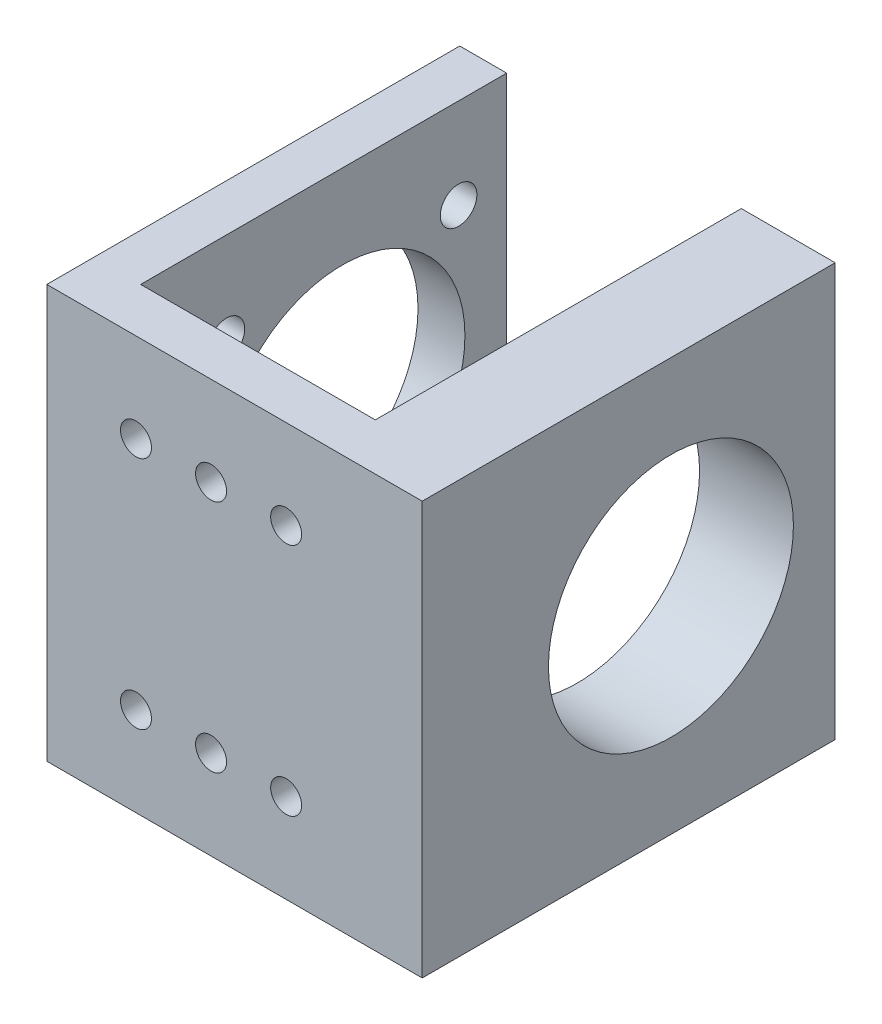
ISO-10303-21;
HEADER;
FILE_DESCRIPTION(('STEP AP214'),'2;1');
FILE_NAME('part.step','',(''),(''),'','','');
FILE_SCHEMA(('AUTOMOTIVE_DESIGN { 1 0 10303 214 1 1 1 1 }'));
ENDSEC;
DATA;
#1=APPLICATION_CONTEXT('core data for automotive mechanical design processes');
#2=APPLICATION_PROTOCOL_DEFINITION('international standard','automotive_design',2000,#1);
#3=PRODUCT_CONTEXT('',#1,'mechanical');
#4=PRODUCT('Part','Part','',(#3));
#5=PRODUCT_RELATED_PRODUCT_CATEGORY('part','',(#4));
#6=PRODUCT_DEFINITION_FORMATION('','',#4);
#7=PRODUCT_DEFINITION_CONTEXT('part definition',#1,'design');
#8=PRODUCT_DEFINITION('design','',#6,#7);
#9=PRODUCT_DEFINITION_SHAPE('','',#8);
#10=(LENGTH_UNIT() NAMED_UNIT(*) SI_UNIT(.MILLI.,.METRE.));
#11=(NAMED_UNIT(*) PLANE_ANGLE_UNIT() SI_UNIT($,.RADIAN.));
#12=(NAMED_UNIT(*) SI_UNIT($,.STERADIAN.) SOLID_ANGLE_UNIT());
#13=UNCERTAINTY_MEASURE_WITH_UNIT(LENGTH_MEASURE(1.E-05),#10,'distance_accuracy_value','');
#14=(GEOMETRIC_REPRESENTATION_CONTEXT(3) GLOBAL_UNCERTAINTY_ASSIGNED_CONTEXT((#13)) GLOBAL_UNIT_ASSIGNED_CONTEXT((#10,
#11,#12)) REPRESENTATION_CONTEXT('',''));
#15=CARTESIAN_POINT('',(0.,0.,0.));
#16=DIRECTION('',(0.,0.,1.));
#17=DIRECTION('',(1.,0.,0.));
#18=AXIS2_PLACEMENT_3D('',#15,#16,#17);
#19=CARTESIAN_POINT('',(-42.2330948121646,44.,18.4776386404293));
#20=DIRECTION('',(0.,0.,1.));
#21=DIRECTION('',(1.,0.,0.));
#22=AXIS2_PLACEMENT_3D('',#19,#20,#21);
#23=PLANE('',#22);
#24=DIRECTION('',(-1.,0.,0.));
#25=VECTOR('',#24,1.);
#26=CARTESIAN_POINT('',(-42.2330948121646,0.,18.4776386404293));
#27=LINE('',#26,#25);
#28=CARTESIAN_POINT('',(-42.2330948121646,0.,18.4776386404293));
#29=VERTEX_POINT('',#28);
#30=CARTESIAN_POINT('',(-47.2330948121646,0.,18.4776386404293));
#31=VERTEX_POINT('',#30);
#32=EDGE_CURVE('E131',#29,#31,#27,.T.);
#33=ORIENTED_EDGE('',*,*,#32,.T.);
#34=DIRECTION('',(0.,-1.,0.));
#35=VECTOR('',#34,1.);
#36=CARTESIAN_POINT('',(-47.2330948121646,44.,18.4776386404293));
#37=LINE('',#36,#35);
#38=CARTESIAN_POINT('',(-47.2330948121646,44.,18.4776386404293));
#39=VERTEX_POINT('',#38);
#40=EDGE_CURVE('E11',#39,#31,#37,.T.);
#41=ORIENTED_EDGE('',*,*,#40,.F.);
#42=DIRECTION('',(-1.,0.,0.));
#43=VECTOR('',#42,1.);
#44=CARTESIAN_POINT('',(-42.2330948121646,44.,18.4776386404293));
#45=LINE('',#44,#43);
#46=CARTESIAN_POINT('',(-42.2330948121646,44.,18.4776386404293));
#47=VERTEX_POINT('',#46);
#48=EDGE_CURVE('E146',#47,#39,#45,.T.);
#49=ORIENTED_EDGE('',*,*,#48,.F.);
#50=DIRECTION('',(0.,-1.,0.));
#51=VECTOR('',#50,1.);
#52=CARTESIAN_POINT('',(-42.2330948121646,44.,18.4776386404293));
#53=LINE('',#52,#51);
#54=EDGE_CURVE('E127',#47,#29,#53,.T.);
#55=ORIENTED_EDGE('',*,*,#54,.T.);
#56=EDGE_LOOP('',(#33,#41,#49,#55));
#57=FACE_BOUND('',#56,.T.);
#58=ADVANCED_FACE('F34',(#57),#23,.F.);
#59=CARTESIAN_POINT('',(-47.2330948121646,44.,18.4776386404293));
#60=DIRECTION('',(1.,0.,0.));
#61=DIRECTION('',(0.,0.,-1.));
#62=AXIS2_PLACEMENT_3D('',#59,#60,#61);
#63=PLANE('',#62);
#64=CARTESIAN_POINT('',(-47.2330948121646,22.,35.9776386404293));
#65=DIRECTION('',(1.,0.,0.));
#66=DIRECTION('',(0.,0.,-1.));
#67=AXIS2_PLACEMENT_3D('',#64,#65,#66);
#68=CIRCLE('',#67,13.05);
#69=CARTESIAN_POINT('',(-47.2330948121646,22.,22.9276386404293));
#70=VERTEX_POINT('',#69);
#71=EDGE_CURVE('E229',#70,#70,#68,.T.);
#72=ORIENTED_EDGE('',*,*,#71,.T.);
#73=EDGE_LOOP('',(#72));
#74=FACE_BOUND('',#73,.T.);
#75=CARTESIAN_POINT('',(-47.2330948121646,34.375,23.6032386404294));
#76=DIRECTION('',(-1.,0.,0.));
#77=DIRECTION('',(0.,0.,1.));
#78=AXIS2_PLACEMENT_3D('',#75,#76,#77);
#79=CIRCLE('',#78,1.95);
#80=CARTESIAN_POINT('',(-47.2330948121646,34.375,25.5532386404294));
#81=VERTEX_POINT('',#80);
#82=EDGE_CURVE('E233',#81,#81,#79,.T.);
#83=ORIENTED_EDGE('',*,*,#82,.F.);
#84=EDGE_LOOP('',(#83));
#85=FACE_BOUND('',#84,.T.);
#86=CARTESIAN_POINT('',(-47.2330948121646,9.62499999999983,48.3432386404293));
#87=DIRECTION('',(-1.,0.,0.));
#88=DIRECTION('',(0.,0.,1.));
#89=AXIS2_PLACEMENT_3D('',#86,#87,#88);
#90=CIRCLE('',#89,1.95);
#91=CARTESIAN_POINT('',(-47.2330948121646,9.62499999999983,50.2932386404293));
#92=VERTEX_POINT('',#91);
#93=EDGE_CURVE('E225',#92,#92,#90,.T.);
#94=ORIENTED_EDGE('',*,*,#93,.F.);
#95=EDGE_LOOP('',(#94));
#96=FACE_BOUND('',#95,.T.);
#97=CARTESIAN_POINT('',(-47.2330948121646,9.625,23.6032386404293));
#98=DIRECTION('',(-1.,0.,0.));
#99=DIRECTION('',(0.,0.,1.));
#100=AXIS2_PLACEMENT_3D('',#97,#98,#99);
#101=CIRCLE('',#100,1.95);
#102=CARTESIAN_POINT('',(-47.2330948121646,9.625,25.5532386404293));
#103=VERTEX_POINT('',#102);
#104=EDGE_CURVE('E226',#103,#103,#101,.T.);
#105=ORIENTED_EDGE('',*,*,#104,.F.);
#106=EDGE_LOOP('',(#105));
#107=FACE_BOUND('',#106,.T.);
#108=CARTESIAN_POINT('',(-47.2330948121646,34.3749999999998,48.3432386404294));
#109=DIRECTION('',(-1.,0.,0.));
#110=DIRECTION('',(0.,0.,1.));
#111=AXIS2_PLACEMENT_3D('',#108,#109,#110);
#112=CIRCLE('',#111,1.95);
#113=CARTESIAN_POINT('',(-47.2330948121646,34.3749999999998,50.2932386404294));
#114=VERTEX_POINT('',#113);
#115=EDGE_CURVE('E218',#114,#114,#112,.T.);
#116=ORIENTED_EDGE('',*,*,#115,.F.);
#117=EDGE_LOOP('',(#116));
#118=FACE_BOUND('',#117,.T.);
#119=DIRECTION('',(0.,0.,1.));
#120=VECTOR('',#119,1.);
#121=CARTESIAN_POINT('',(-47.2330948121646,0.,18.4776386404293));
#122=LINE('',#121,#120);
#123=CARTESIAN_POINT('',(-47.2330948121646,0.,62.4776386404293));
#124=VERTEX_POINT('',#123);
#125=EDGE_CURVE('E134',#31,#124,#122,.T.);
#126=ORIENTED_EDGE('',*,*,#125,.T.);
#127=DIRECTION('',(0.,-1.,0.));
#128=VECTOR('',#127,1.);
#129=CARTESIAN_POINT('',(-47.2330948121646,44.,62.4776386404293));
#130=LINE('',#129,#128);
#131=CARTESIAN_POINT('',(-47.2330948121646,44.,62.4776386404293));
#132=VERTEX_POINT('',#131);
#133=EDGE_CURVE('E43',#132,#124,#130,.T.);
#134=ORIENTED_EDGE('',*,*,#133,.F.);
#135=DIRECTION('',(0.,0.,1.));
#136=VECTOR('',#135,1.);
#137=CARTESIAN_POINT('',(-47.2330948121646,44.,18.4776386404293));
#138=LINE('',#137,#136);
#139=EDGE_CURVE('E94',#39,#132,#138,.T.);
#140=ORIENTED_EDGE('',*,*,#139,.F.);
#141=ORIENTED_EDGE('',*,*,#40,.T.);
#142=EDGE_LOOP('',(#126,#134,#140,#141));
#143=FACE_BOUND('',#142,.T.);
#144=ADVANCED_FACE('F263',(#74,#85,#96,#107,#118,#143),#63,.F.);
#145=CARTESIAN_POINT('',(-47.2330948121646,44.,62.4776386404293));
#146=DIRECTION('',(0.,0.,-1.));
#147=DIRECTION('',(-1.,0.,0.));
#148=AXIS2_PLACEMENT_3D('',#145,#146,#147);
#149=PLANE('',#148);
#150=CARTESIAN_POINT('',(-21.7330948121648,9.49999999999988,62.4776386404293));
#151=DIRECTION('',(0.,0.,-1.));
#152=DIRECTION('',(-1.,0.,0.));
#153=AXIS2_PLACEMENT_3D('',#150,#151,#152);
#154=CIRCLE('',#153,1.65);
#155=CARTESIAN_POINT('',(-23.3830948121648,9.49999999999988,62.4776386404293));
#156=VERTEX_POINT('',#155);
#157=EDGE_CURVE('E185',#156,#156,#154,.T.);
#158=ORIENTED_EDGE('',*,*,#157,.T.);
#159=EDGE_LOOP('',(#158));
#160=FACE_BOUND('',#159,.T.);
#161=CARTESIAN_POINT('',(-21.7330948121645,34.4999999999999,62.4776386404293));
#162=DIRECTION('',(0.,0.,-1.));
#163=DIRECTION('',(-1.,0.,0.));
#164=AXIS2_PLACEMENT_3D('',#161,#162,#163);
#165=CIRCLE('',#164,1.65);
#166=CARTESIAN_POINT('',(-23.3830948121645,34.4999999999999,62.4776386404293));
#167=VERTEX_POINT('',#166);
#168=EDGE_CURVE('E188',#167,#167,#165,.T.);
#169=ORIENTED_EDGE('',*,*,#168,.T.);
#170=EDGE_LOOP('',(#169));
#171=FACE_BOUND('',#170,.T.);
#172=CARTESIAN_POINT('',(-37.7330948121648,9.49999999999999,62.4776386404293));
#173=DIRECTION('',(0.,0.,-1.));
#174=DIRECTION('',(-1.,0.,0.));
#175=AXIS2_PLACEMENT_3D('',#172,#173,#174);
#176=CIRCLE('',#175,1.65);
#177=CARTESIAN_POINT('',(-39.3830948121648,9.49999999999999,62.4776386404293));
#178=VERTEX_POINT('',#177);
#179=EDGE_CURVE('E191',#178,#178,#176,.T.);
#180=ORIENTED_EDGE('',*,*,#179,.T.);
#181=EDGE_LOOP('',(#180));
#182=FACE_BOUND('',#181,.T.);
#183=CARTESIAN_POINT('',(-37.7330948121646,34.5,62.4776386404293));
#184=DIRECTION('',(0.,0.,-1.));
#185=DIRECTION('',(-1.,0.,0.));
#186=AXIS2_PLACEMENT_3D('',#183,#184,#185);
#187=CIRCLE('',#186,1.65);
#188=CARTESIAN_POINT('',(-39.3830948121646,34.5,62.4776386404293));
#189=VERTEX_POINT('',#188);
#190=EDGE_CURVE('E194',#189,#189,#187,.T.);
#191=ORIENTED_EDGE('',*,*,#190,.T.);
#192=EDGE_LOOP('',(#191));
#193=FACE_BOUND('',#192,.T.);
#194=CARTESIAN_POINT('',(-29.7330948121648,9.49999999999994,62.4776386404293));
#195=DIRECTION('',(0.,0.,-1.));
#196=DIRECTION('',(-1.,0.,0.));
#197=AXIS2_PLACEMENT_3D('',#194,#195,#196);
#198=CIRCLE('',#197,1.65000000000001);
#199=CARTESIAN_POINT('',(-31.3830948121648,9.49999999999994,62.4776386404293));
#200=VERTEX_POINT('',#199);
#201=EDGE_CURVE('E197',#200,#200,#198,.T.);
#202=ORIENTED_EDGE('',*,*,#201,.T.);
#203=EDGE_LOOP('',(#202));
#204=FACE_BOUND('',#203,.T.);
#205=CARTESIAN_POINT('',(-29.7330948121645,34.4999999999999,62.4776386404293));
#206=DIRECTION('',(0.,0.,-1.));
#207=DIRECTION('',(-1.,0.,0.));
#208=AXIS2_PLACEMENT_3D('',#205,#206,#207);
#209=CIRCLE('',#208,1.65000000000001);
#210=CARTESIAN_POINT('',(-31.3830948121646,34.4999999999999,62.4776386404293));
#211=VERTEX_POINT('',#210);
#212=EDGE_CURVE('E135',#211,#211,#209,.T.);
#213=ORIENTED_EDGE('',*,*,#212,.T.);
#214=EDGE_LOOP('',(#213));
#215=FACE_BOUND('',#214,.T.);
#216=DIRECTION('',(1.,0.,0.));
#217=VECTOR('',#216,1.);
#218=CARTESIAN_POINT('',(-47.2330948121646,0.,62.4776386404293));
#219=LINE('',#218,#217);
#220=CARTESIAN_POINT('',(-7.23309481216456,0.,62.4776386404293));
#221=VERTEX_POINT('',#220);
#222=EDGE_CURVE('E137',#124,#221,#219,.T.);
#223=ORIENTED_EDGE('',*,*,#222,.T.);
#224=DIRECTION('',(0.,-1.,0.));
#225=VECTOR('',#224,1.);
#226=CARTESIAN_POINT('',(-7.23309481216456,44.,62.4776386404293));
#227=LINE('',#226,#225);
#228=CARTESIAN_POINT('',(-7.23309481216456,44.,62.4776386404293));
#229=VERTEX_POINT('',#228);
#230=EDGE_CURVE('E153',#229,#221,#227,.T.);
#231=ORIENTED_EDGE('',*,*,#230,.F.);
#232=DIRECTION('',(1.,0.,0.));
#233=VECTOR('',#232,1.);
#234=CARTESIAN_POINT('',(-47.2330948121646,44.,62.4776386404293));
#235=LINE('',#234,#233);
#236=EDGE_CURVE('E162',#132,#229,#235,.T.);
#237=ORIENTED_EDGE('',*,*,#236,.F.);
#238=ORIENTED_EDGE('',*,*,#133,.T.);
#239=EDGE_LOOP('',(#223,#231,#237,#238));
#240=FACE_BOUND('',#239,.T.);
#241=ADVANCED_FACE('F160',(#160,#171,#182,#193,#204,#215,#240),#149,.F.);
#242=CARTESIAN_POINT('',(-7.23309481216456,44.,62.4776386404293));
#243=DIRECTION('',(-1.,0.,0.));
#244=DIRECTION('',(0.,0.,1.));
#245=AXIS2_PLACEMENT_3D('',#242,#243,#244);
#246=PLANE('',#245);
#247=CARTESIAN_POINT('',(-7.23309481216456,22.,35.9776386404293));
#248=DIRECTION('',(1.,0.,0.));
#249=DIRECTION('',(0.,0.,-1.));
#250=AXIS2_PLACEMENT_3D('',#247,#248,#249);
#251=CIRCLE('',#250,13.05);
#252=CARTESIAN_POINT('',(-7.23309481216456,22.,22.9276386404293));
#253=VERTEX_POINT('',#252);
#254=EDGE_CURVE('E245',#253,#253,#251,.T.);
#255=ORIENTED_EDGE('',*,*,#254,.F.);
#256=EDGE_LOOP('',(#255));
#257=FACE_BOUND('',#256,.T.);
#258=DIRECTION('',(0.,0.,-1.));
#259=VECTOR('',#258,1.);
#260=CARTESIAN_POINT('',(-7.23309481216456,0.,62.4776386404293));
#261=LINE('',#260,#259);
#262=CARTESIAN_POINT('',(-7.23309481216456,0.,18.4776386404293));
#263=VERTEX_POINT('',#262);
#264=EDGE_CURVE('E139',#221,#263,#261,.T.);
#265=ORIENTED_EDGE('',*,*,#264,.T.);
#266=DIRECTION('',(0.,-1.,0.));
#267=VECTOR('',#266,1.);
#268=CARTESIAN_POINT('',(-7.23309481216456,44.,18.4776386404293));
#269=LINE('',#268,#267);
#270=CARTESIAN_POINT('',(-7.23309481216456,44.,18.4776386404293));
#271=VERTEX_POINT('',#270);
#272=EDGE_CURVE('E150',#271,#263,#269,.T.);
#273=ORIENTED_EDGE('',*,*,#272,.F.);
#274=DIRECTION('',(0.,0.,-1.));
#275=VECTOR('',#274,1.);
#276=CARTESIAN_POINT('',(-7.23309481216456,44.,62.4776386404293));
#277=LINE('',#276,#275);
#278=EDGE_CURVE('E174',#229,#271,#277,.T.);
#279=ORIENTED_EDGE('',*,*,#278,.F.);
#280=ORIENTED_EDGE('',*,*,#230,.T.);
#281=EDGE_LOOP('',(#265,#273,#279,#280));
#282=FACE_BOUND('',#281,.T.);
#283=ADVANCED_FACE('F170',(#257,#282),#246,.F.);
#284=CARTESIAN_POINT('',(-7.23309481216456,44.,18.4776386404293));
#285=DIRECTION('',(0.,0.,1.));
#286=DIRECTION('',(1.,0.,0.));
#287=AXIS2_PLACEMENT_3D('',#284,#285,#286);
#288=PLANE('',#287);
#289=DIRECTION('',(-1.,0.,0.));
#290=VECTOR('',#289,1.);
#291=CARTESIAN_POINT('',(-7.23309481216456,0.,18.4776386404293));
#292=LINE('',#291,#290);
#293=CARTESIAN_POINT('',(-17.2330948121646,0.,18.4776386404293));
#294=VERTEX_POINT('',#293);
#295=EDGE_CURVE('E141',#263,#294,#292,.T.);
#296=ORIENTED_EDGE('',*,*,#295,.T.);
#297=DIRECTION('',(0.,-1.,0.));
#298=VECTOR('',#297,1.);
#299=CARTESIAN_POINT('',(-17.2330948121646,44.,18.4776386404293));
#300=LINE('',#299,#298);
#301=CARTESIAN_POINT('',(-17.2330948121646,44.,18.4776386404293));
#302=VERTEX_POINT('',#301);
#303=EDGE_CURVE('E122',#302,#294,#300,.T.);
#304=ORIENTED_EDGE('',*,*,#303,.F.);
#305=DIRECTION('',(-1.,0.,0.));
#306=VECTOR('',#305,1.);
#307=CARTESIAN_POINT('',(-7.23309481216456,44.,18.4776386404293));
#308=LINE('',#307,#306);
#309=EDGE_CURVE('E113',#271,#302,#308,.T.);
#310=ORIENTED_EDGE('',*,*,#309,.F.);
#311=ORIENTED_EDGE('',*,*,#272,.T.);
#312=EDGE_LOOP('',(#296,#304,#310,#311));
#313=FACE_BOUND('',#312,.T.);
#314=ADVANCED_FACE('F173',(#313),#288,.F.);
#315=CARTESIAN_POINT('',(-17.2330948121646,44.,18.4776386404293));
#316=DIRECTION('',(1.,0.,0.));
#317=DIRECTION('',(0.,0.,-1.));
#318=AXIS2_PLACEMENT_3D('',#315,#316,#317);
#319=PLANE('',#318);
#320=CARTESIAN_POINT('',(-17.2330948121646,22.,35.9776386404293));
#321=DIRECTION('',(1.,0.,0.));
#322=DIRECTION('',(0.,0.,-1.));
#323=AXIS2_PLACEMENT_3D('',#320,#321,#322);
#324=CIRCLE('',#323,13.05);
#325=CARTESIAN_POINT('',(-17.2330948121646,22.,22.9276386404293));
#326=VERTEX_POINT('',#325);
#327=EDGE_CURVE('E242',#326,#326,#324,.T.);
#328=ORIENTED_EDGE('',*,*,#327,.T.);
#329=EDGE_LOOP('',(#328));
#330=FACE_BOUND('',#329,.T.);
#331=DIRECTION('',(0.,0.,1.));
#332=VECTOR('',#331,1.);
#333=CARTESIAN_POINT('',(-17.2330948121646,0.,18.4776386404293));
#334=LINE('',#333,#332);
#335=CARTESIAN_POINT('',(-17.2330948121646,0.,57.4776386404293));
#336=VERTEX_POINT('',#335);
#337=EDGE_CURVE('E121',#294,#336,#334,.T.);
#338=ORIENTED_EDGE('',*,*,#337,.T.);
#339=DIRECTION('',(0.,-1.,0.));
#340=VECTOR('',#339,1.);
#341=CARTESIAN_POINT('',(-17.2330948121646,44.,57.4776386404293));
#342=LINE('',#341,#340);
#343=CARTESIAN_POINT('',(-17.2330948121646,44.,57.4776386404293));
#344=VERTEX_POINT('',#343);
#345=EDGE_CURVE('E118',#344,#336,#342,.T.);
#346=ORIENTED_EDGE('',*,*,#345,.F.);
#347=DIRECTION('',(0.,0.,1.));
#348=VECTOR('',#347,1.);
#349=CARTESIAN_POINT('',(-17.2330948121646,44.,18.4776386404293));
#350=LINE('',#349,#348);
#351=EDGE_CURVE('E107',#302,#344,#350,.T.);
#352=ORIENTED_EDGE('',*,*,#351,.F.);
#353=ORIENTED_EDGE('',*,*,#303,.T.);
#354=EDGE_LOOP('',(#338,#346,#352,#353));
#355=FACE_BOUND('',#354,.T.);
#356=ADVANCED_FACE('F119',(#330,#355),#319,.F.);
#357=CARTESIAN_POINT('',(-17.2330948121646,44.,57.4776386404293));
#358=DIRECTION('',(0.,0.,1.));
#359=DIRECTION('',(1.,0.,0.));
#360=AXIS2_PLACEMENT_3D('',#357,#358,#359);
#361=PLANE('',#360);
#362=CARTESIAN_POINT('',(-21.7330948121648,9.49999999999988,57.4776386404293));
#363=DIRECTION('',(0.,0.,-1.));
#364=DIRECTION('',(-1.,0.,0.));
#365=AXIS2_PLACEMENT_3D('',#362,#363,#364);
#366=CIRCLE('',#365,1.65);
#367=CARTESIAN_POINT('',(-23.3830948121648,9.49999999999988,57.4776386404293));
#368=VERTEX_POINT('',#367);
#369=EDGE_CURVE('E207',#368,#368,#366,.T.);
#370=ORIENTED_EDGE('',*,*,#369,.F.);
#371=EDGE_LOOP('',(#370));
#372=FACE_BOUND('',#371,.T.);
#373=CARTESIAN_POINT('',(-21.7330948121645,34.4999999999999,57.4776386404293));
#374=DIRECTION('',(0.,0.,-1.));
#375=DIRECTION('',(-1.,0.,0.));
#376=AXIS2_PLACEMENT_3D('',#373,#374,#375);
#377=CIRCLE('',#376,1.65);
#378=CARTESIAN_POINT('',(-23.3830948121646,34.4999999999999,57.4776386404293));
#379=VERTEX_POINT('',#378);
#380=EDGE_CURVE('E210',#379,#379,#377,.T.);
#381=ORIENTED_EDGE('',*,*,#380,.F.);
#382=EDGE_LOOP('',(#381));
#383=FACE_BOUND('',#382,.T.);
#384=CARTESIAN_POINT('',(-37.7330948121648,9.49999999999999,57.4776386404293));
#385=DIRECTION('',(0.,0.,-1.));
#386=DIRECTION('',(-1.,0.,0.));
#387=AXIS2_PLACEMENT_3D('',#384,#385,#386);
#388=CIRCLE('',#387,1.65);
#389=CARTESIAN_POINT('',(-39.3830948121648,9.49999999999999,57.4776386404293));
#390=VERTEX_POINT('',#389);
#391=EDGE_CURVE('E204',#390,#390,#388,.T.);
#392=ORIENTED_EDGE('',*,*,#391,.F.);
#393=EDGE_LOOP('',(#392));
#394=FACE_BOUND('',#393,.T.);
#395=CARTESIAN_POINT('',(-37.7330948121646,34.5,57.4776386404293));
#396=DIRECTION('',(0.,0.,-1.));
#397=DIRECTION('',(-1.,0.,0.));
#398=AXIS2_PLACEMENT_3D('',#395,#396,#397);
#399=CIRCLE('',#398,1.65);
#400=CARTESIAN_POINT('',(-39.3830948121646,34.5,57.4776386404293));
#401=VERTEX_POINT('',#400);
#402=EDGE_CURVE('E201',#401,#401,#399,.T.);
#403=ORIENTED_EDGE('',*,*,#402,.F.);
#404=EDGE_LOOP('',(#403));
#405=FACE_BOUND('',#404,.T.);
#406=CARTESIAN_POINT('',(-29.7330948121648,9.49999999999994,57.4776386404293));
#407=DIRECTION('',(0.,0.,-1.));
#408=DIRECTION('',(-1.,0.,0.));
#409=AXIS2_PLACEMENT_3D('',#406,#407,#408);
#410=CIRCLE('',#409,1.65000000000001);
#411=CARTESIAN_POINT('',(-31.3830948121648,9.49999999999994,57.4776386404293));
#412=VERTEX_POINT('',#411);
#413=EDGE_CURVE('E200',#412,#412,#410,.T.);
#414=ORIENTED_EDGE('',*,*,#413,.F.);
#415=EDGE_LOOP('',(#414));
#416=FACE_BOUND('',#415,.T.);
#417=CARTESIAN_POINT('',(-29.7330948121645,34.4999999999999,57.4776386404293));
#418=DIRECTION('',(0.,0.,-1.));
#419=DIRECTION('',(-1.,0.,0.));
#420=AXIS2_PLACEMENT_3D('',#417,#418,#419);
#421=CIRCLE('',#420,1.65000000000001);
#422=CARTESIAN_POINT('',(-31.3830948121646,34.4999999999999,57.4776386404293));
#423=VERTEX_POINT('',#422);
#424=EDGE_CURVE('E182',#423,#423,#421,.T.);
#425=ORIENTED_EDGE('',*,*,#424,.F.);
#426=EDGE_LOOP('',(#425));
#427=FACE_BOUND('',#426,.T.);
#428=DIRECTION('',(-1.,0.,0.));
#429=VECTOR('',#428,1.);
#430=CARTESIAN_POINT('',(-17.2330948121646,0.,57.4776386404293));
#431=LINE('',#430,#429);
#432=CARTESIAN_POINT('',(-42.2330948121646,0.,57.4776386404293));
#433=VERTEX_POINT('',#432);
#434=EDGE_CURVE('E80',#336,#433,#431,.T.);
#435=ORIENTED_EDGE('',*,*,#434,.T.);
#436=DIRECTION('',(0.,-1.,0.));
#437=VECTOR('',#436,1.);
#438=CARTESIAN_POINT('',(-42.2330948121646,44.,57.4776386404293));
#439=LINE('',#438,#437);
#440=CARTESIAN_POINT('',(-42.2330948121646,44.,57.4776386404293));
#441=VERTEX_POINT('',#440);
#442=EDGE_CURVE('E123',#441,#433,#439,.T.);
#443=ORIENTED_EDGE('',*,*,#442,.F.);
#444=DIRECTION('',(-1.,0.,0.));
#445=VECTOR('',#444,1.);
#446=CARTESIAN_POINT('',(-17.2330948121646,44.,57.4776386404293));
#447=LINE('',#446,#445);
#448=EDGE_CURVE('E111',#344,#441,#447,.T.);
#449=ORIENTED_EDGE('',*,*,#448,.F.);
#450=ORIENTED_EDGE('',*,*,#345,.T.);
#451=EDGE_LOOP('',(#435,#443,#449,#450));
#452=FACE_BOUND('',#451,.T.);
#453=ADVANCED_FACE('F125',(#372,#383,#394,#405,#416,#427,#452),#361,.F.);
#454=CARTESIAN_POINT('',(-42.2330948121646,44.,57.4776386404293));
#455=DIRECTION('',(-1.,0.,0.));
#456=DIRECTION('',(0.,0.,1.));
#457=AXIS2_PLACEMENT_3D('',#454,#455,#456);
#458=PLANE('',#457);
#459=CARTESIAN_POINT('',(-42.2330948121646,22.,35.9776386404293));
#460=DIRECTION('',(-1.,0.,0.));
#461=DIRECTION('',(0.,0.,1.));
#462=AXIS2_PLACEMENT_3D('',#459,#460,#461);
#463=CIRCLE('',#462,13.05);
#464=CARTESIAN_POINT('',(-42.2330948121646,22.,49.0276386404293));
#465=VERTEX_POINT('',#464);
#466=EDGE_CURVE('E37',#465,#465,#463,.T.);
#467=ORIENTED_EDGE('',*,*,#466,.T.);
#468=EDGE_LOOP('',(#467));
#469=FACE_BOUND('',#468,.T.);
#470=CARTESIAN_POINT('',(-42.2330948121646,34.375,23.6032386404294));
#471=DIRECTION('',(-1.,0.,0.));
#472=DIRECTION('',(0.,0.,1.));
#473=AXIS2_PLACEMENT_3D('',#470,#471,#472);
#474=CIRCLE('',#473,1.95);
#475=CARTESIAN_POINT('',(-42.2330948121646,34.375,25.5532386404294));
#476=VERTEX_POINT('',#475);
#477=EDGE_CURVE('E221',#476,#476,#474,.F.);
#478=ORIENTED_EDGE('',*,*,#477,.F.);
#479=EDGE_LOOP('',(#478));
#480=FACE_BOUND('',#479,.T.);
#481=CARTESIAN_POINT('',(-42.2330948121646,9.62499999999983,48.3432386404293));
#482=DIRECTION('',(-1.,0.,0.));
#483=DIRECTION('',(0.,0.,1.));
#484=AXIS2_PLACEMENT_3D('',#481,#482,#483);
#485=CIRCLE('',#484,1.95);
#486=CARTESIAN_POINT('',(-42.2330948121646,9.62499999999983,50.2932386404293));
#487=VERTEX_POINT('',#486);
#488=EDGE_CURVE('E230',#487,#487,#485,.F.);
#489=ORIENTED_EDGE('',*,*,#488,.F.);
#490=EDGE_LOOP('',(#489));
#491=FACE_BOUND('',#490,.T.);
#492=CARTESIAN_POINT('',(-42.2330948121646,9.625,23.6032386404293));
#493=DIRECTION('',(-1.,0.,0.));
#494=DIRECTION('',(0.,0.,1.));
#495=AXIS2_PLACEMENT_3D('',#492,#493,#494);
#496=CIRCLE('',#495,1.95);
#497=CARTESIAN_POINT('',(-42.2330948121646,9.625,25.5532386404293));
#498=VERTEX_POINT('',#497);
#499=EDGE_CURVE('E222',#498,#498,#496,.F.);
#500=ORIENTED_EDGE('',*,*,#499,.F.);
#501=EDGE_LOOP('',(#500));
#502=FACE_BOUND('',#501,.T.);
#503=CARTESIAN_POINT('',(-42.2330948121646,34.3749999999998,48.3432386404294));
#504=DIRECTION('',(-1.,0.,0.));
#505=DIRECTION('',(0.,0.,1.));
#506=AXIS2_PLACEMENT_3D('',#503,#504,#505);
#507=CIRCLE('',#506,1.95);
#508=CARTESIAN_POINT('',(-42.2330948121646,34.3749999999998,50.2932386404294));
#509=VERTEX_POINT('',#508);
#510=EDGE_CURVE('E211',#509,#509,#507,.F.);
#511=ORIENTED_EDGE('',*,*,#510,.F.);
#512=EDGE_LOOP('',(#511));
#513=FACE_BOUND('',#512,.T.);
#514=DIRECTION('',(0.,0.,-1.));
#515=VECTOR('',#514,1.);
#516=CARTESIAN_POINT('',(-42.2330948121646,0.,57.4776386404293));
#517=LINE('',#516,#515);
#518=EDGE_CURVE('E86',#433,#29,#517,.T.);
#519=ORIENTED_EDGE('',*,*,#518,.T.);
#520=ORIENTED_EDGE('',*,*,#54,.F.);
#521=DIRECTION('',(0.,0.,-1.));
#522=VECTOR('',#521,1.);
#523=CARTESIAN_POINT('',(-42.2330948121646,44.,57.4776386404293));
#524=LINE('',#523,#522);
#525=EDGE_CURVE('E51',#441,#47,#524,.T.);
#526=ORIENTED_EDGE('',*,*,#525,.F.);
#527=ORIENTED_EDGE('',*,*,#442,.T.);
#528=EDGE_LOOP('',(#519,#520,#526,#527));
#529=FACE_BOUND('',#528,.T.);
#530=ADVANCED_FACE('F252',(#469,#480,#491,#502,#513,#529),#458,.F.);
#531=CARTESIAN_POINT('',(0.,44.,0.));
#532=DIRECTION('',(0.,1.,0.));
#533=DIRECTION('',(0.,0.,1.));
#534=AXIS2_PLACEMENT_3D('',#531,#532,#533);
#535=PLANE('',#534);
#536=ORIENTED_EDGE('',*,*,#48,.T.);
#537=ORIENTED_EDGE('',*,*,#139,.T.);
#538=ORIENTED_EDGE('',*,*,#236,.T.);
#539=ORIENTED_EDGE('',*,*,#278,.T.);
#540=ORIENTED_EDGE('',*,*,#309,.T.);
#541=ORIENTED_EDGE('',*,*,#351,.T.);
#542=ORIENTED_EDGE('',*,*,#448,.T.);
#543=ORIENTED_EDGE('',*,*,#525,.T.);
#544=EDGE_LOOP('',(#536,#537,#538,#539,#540,#541,#542,#543));
#545=FACE_BOUND('',#544,.T.);
#546=ADVANCED_FACE('F109',(#545),#535,.T.);
#547=CARTESIAN_POINT('',(0.,0.,0.));
#548=DIRECTION('',(0.,1.,0.));
#549=DIRECTION('',(0.,0.,1.));
#550=AXIS2_PLACEMENT_3D('',#547,#548,#549);
#551=PLANE('',#550);
#552=ORIENTED_EDGE('',*,*,#32,.F.);
#553=ORIENTED_EDGE('',*,*,#518,.F.);
#554=ORIENTED_EDGE('',*,*,#434,.F.);
#555=ORIENTED_EDGE('',*,*,#337,.F.);
#556=ORIENTED_EDGE('',*,*,#295,.F.);
#557=ORIENTED_EDGE('',*,*,#264,.F.);
#558=ORIENTED_EDGE('',*,*,#222,.F.);
#559=ORIENTED_EDGE('',*,*,#125,.F.);
#560=EDGE_LOOP('',(#552,#553,#554,#555,#556,#557,#558,#559));
#561=FACE_BOUND('',#560,.T.);
#562=ADVANCED_FACE('F166',(#561),#551,.F.);
#563=CARTESIAN_POINT('',(-29.7330948121645,34.4999999999999,101.477638640429));
#564=DIRECTION('',(0.,0.,-1.));
#565=DIRECTION('',(-1.,0.,0.));
#566=AXIS2_PLACEMENT_3D('',#563,#564,#565);
#567=CYLINDRICAL_SURFACE('',#566,1.65000000000001);
#568=ORIENTED_EDGE('',*,*,#424,.T.);
#569=EDGE_LOOP('',(#568));
#570=FACE_BOUND('',#569,.T.);
#571=ORIENTED_EDGE('',*,*,#212,.F.);
#572=EDGE_LOOP('',(#571));
#573=FACE_BOUND('',#572,.T.);
#574=ADVANCED_FACE('F333',(#570,#573),#567,.F.);
#575=CARTESIAN_POINT('',(-29.7330948121648,9.49999999999994,101.477638640429));
#576=DIRECTION('',(0.,0.,-1.));
#577=DIRECTION('',(-1.,0.,0.));
#578=AXIS2_PLACEMENT_3D('',#575,#576,#577);
#579=CYLINDRICAL_SURFACE('',#578,1.65000000000001);
#580=ORIENTED_EDGE('',*,*,#413,.T.);
#581=EDGE_LOOP('',(#580));
#582=FACE_BOUND('',#581,.T.);
#583=ORIENTED_EDGE('',*,*,#201,.F.);
#584=EDGE_LOOP('',(#583));
#585=FACE_BOUND('',#584,.T.);
#586=ADVANCED_FACE('F338',(#582,#585),#579,.F.);
#587=CARTESIAN_POINT('',(-37.7330948121645,34.5,101.477638640429));
#588=DIRECTION('',(0.,0.,-1.));
#589=DIRECTION('',(-1.,0.,0.));
#590=AXIS2_PLACEMENT_3D('',#587,#588,#589);
#591=CYLINDRICAL_SURFACE('',#590,1.65);
#592=ORIENTED_EDGE('',*,*,#402,.T.);
#593=EDGE_LOOP('',(#592));
#594=FACE_BOUND('',#593,.T.);
#595=ORIENTED_EDGE('',*,*,#190,.F.);
#596=EDGE_LOOP('',(#595));
#597=FACE_BOUND('',#596,.T.);
#598=ADVANCED_FACE('F350',(#594,#597),#591,.F.);
#599=CARTESIAN_POINT('',(-37.7330948121648,9.49999999999999,101.477638640429));
#600=DIRECTION('',(0.,0.,-1.));
#601=DIRECTION('',(-1.,0.,0.));
#602=AXIS2_PLACEMENT_3D('',#599,#600,#601);
#603=CYLINDRICAL_SURFACE('',#602,1.65);
#604=ORIENTED_EDGE('',*,*,#391,.T.);
#605=EDGE_LOOP('',(#604));
#606=FACE_BOUND('',#605,.T.);
#607=ORIENTED_EDGE('',*,*,#179,.F.);
#608=EDGE_LOOP('',(#607));
#609=FACE_BOUND('',#608,.T.);
#610=ADVANCED_FACE('F360',(#606,#609),#603,.F.);
#611=CARTESIAN_POINT('',(-21.7330948121645,34.4999999999999,101.477638640429));
#612=DIRECTION('',(0.,0.,-1.));
#613=DIRECTION('',(-1.,0.,0.));
#614=AXIS2_PLACEMENT_3D('',#611,#612,#613);
#615=CYLINDRICAL_SURFACE('',#614,1.65);
#616=ORIENTED_EDGE('',*,*,#380,.T.);
#617=EDGE_LOOP('',(#616));
#618=FACE_BOUND('',#617,.T.);
#619=ORIENTED_EDGE('',*,*,#168,.F.);
#620=EDGE_LOOP('',(#619));
#621=FACE_BOUND('',#620,.T.);
#622=ADVANCED_FACE('F370',(#618,#621),#615,.F.);
#623=CARTESIAN_POINT('',(-21.7330948121648,9.49999999999988,101.477638640429));
#624=DIRECTION('',(0.,0.,-1.));
#625=DIRECTION('',(-1.,0.,0.));
#626=AXIS2_PLACEMENT_3D('',#623,#624,#625);
#627=CYLINDRICAL_SURFACE('',#626,1.65);
#628=ORIENTED_EDGE('',*,*,#369,.T.);
#629=EDGE_LOOP('',(#628));
#630=FACE_BOUND('',#629,.T.);
#631=ORIENTED_EDGE('',*,*,#157,.F.);
#632=EDGE_LOOP('',(#631));
#633=FACE_BOUND('',#632,.T.);
#634=ADVANCED_FACE('F380',(#630,#633),#627,.F.);
#635=CARTESIAN_POINT('',(-36.7176619189095,34.3749999999998,48.3432386404294));
#636=DIRECTION('',(-1.,0.,0.));
#637=DIRECTION('',(0.,0.,1.));
#638=AXIS2_PLACEMENT_3D('',#635,#636,#637);
#639=CYLINDRICAL_SURFACE('',#638,1.95);
#640=ORIENTED_EDGE('',*,*,#510,.T.);
#641=EDGE_LOOP('',(#640));
#642=FACE_BOUND('',#641,.T.);
#643=ORIENTED_EDGE('',*,*,#115,.T.);
#644=EDGE_LOOP('',(#643));
#645=FACE_BOUND('',#644,.T.);
#646=ADVANCED_FACE('F390',(#642,#645),#639,.F.);
#647=CARTESIAN_POINT('',(-36.7176619189095,9.625,23.6032386404293));
#648=DIRECTION('',(-1.,0.,0.));
#649=DIRECTION('',(0.,0.,1.));
#650=AXIS2_PLACEMENT_3D('',#647,#648,#649);
#651=CYLINDRICAL_SURFACE('',#650,1.95);
#652=ORIENTED_EDGE('',*,*,#499,.T.);
#653=EDGE_LOOP('',(#652));
#654=FACE_BOUND('',#653,.T.);
#655=ORIENTED_EDGE('',*,*,#104,.T.);
#656=EDGE_LOOP('',(#655));
#657=FACE_BOUND('',#656,.T.);
#658=ADVANCED_FACE('F400',(#654,#657),#651,.F.);
#659=CARTESIAN_POINT('',(-36.7176619189095,9.62499999999983,48.3432386404293));
#660=DIRECTION('',(-1.,0.,0.));
#661=DIRECTION('',(0.,0.,1.));
#662=AXIS2_PLACEMENT_3D('',#659,#660,#661);
#663=CYLINDRICAL_SURFACE('',#662,1.95);
#664=ORIENTED_EDGE('',*,*,#488,.T.);
#665=EDGE_LOOP('',(#664));
#666=FACE_BOUND('',#665,.T.);
#667=ORIENTED_EDGE('',*,*,#93,.T.);
#668=EDGE_LOOP('',(#667));
#669=FACE_BOUND('',#668,.T.);
#670=ADVANCED_FACE('F410',(#666,#669),#663,.F.);
#671=CARTESIAN_POINT('',(-36.7176619189095,34.375,23.6032386404294));
#672=DIRECTION('',(-1.,0.,0.));
#673=DIRECTION('',(0.,0.,1.));
#674=AXIS2_PLACEMENT_3D('',#671,#672,#673);
#675=CYLINDRICAL_SURFACE('',#674,1.95);
#676=ORIENTED_EDGE('',*,*,#477,.T.);
#677=EDGE_LOOP('',(#676));
#678=FACE_BOUND('',#677,.T.);
#679=ORIENTED_EDGE('',*,*,#82,.T.);
#680=EDGE_LOOP('',(#679));
#681=FACE_BOUND('',#680,.T.);
#682=ADVANCED_FACE('F259',(#678,#681),#675,.F.);
#683=CARTESIAN_POINT('',(-60.2330948121646,22.,35.9776386404293));
#684=DIRECTION('',(1.,0.,0.));
#685=DIRECTION('',(0.,0.,-1.));
#686=AXIS2_PLACEMENT_3D('',#683,#684,#685);
#687=CYLINDRICAL_SURFACE('',#686,13.05);
#688=ORIENTED_EDGE('',*,*,#466,.F.);
#689=EDGE_LOOP('',(#688));
#690=FACE_BOUND('',#689,.T.);
#691=ORIENTED_EDGE('',*,*,#71,.F.);
#692=EDGE_LOOP('',(#691));
#693=FACE_BOUND('',#692,.T.);
#694=ADVANCED_FACE('F255',(#690,#693),#687,.F.);
#695=ORIENTED_EDGE('',*,*,#254,.T.);
#696=EDGE_LOOP('',(#695));
#697=FACE_BOUND('',#696,.T.);
#698=ORIENTED_EDGE('',*,*,#327,.F.);
#699=EDGE_LOOP('',(#698));
#700=FACE_BOUND('',#699,.T.);
#701=ADVANCED_FACE('F258',(#697,#700),#687,.F.);
#702=CLOSED_SHELL('',(#58,#144,#241,#283,#314,#356,#453,#530,#546,#562,#574,#586,#598,#610,#622,
#634,#646,#658,#670,#682,#694,#701));
#703=MANIFOLD_SOLID_BREP('B2',#702);
#704=ADVANCED_BREP_SHAPE_REPRESENTATION('',(#18,#703),#14);
#705=SHAPE_DEFINITION_REPRESENTATION(#9,#704);
ENDSEC;
END-ISO-10303-21;
